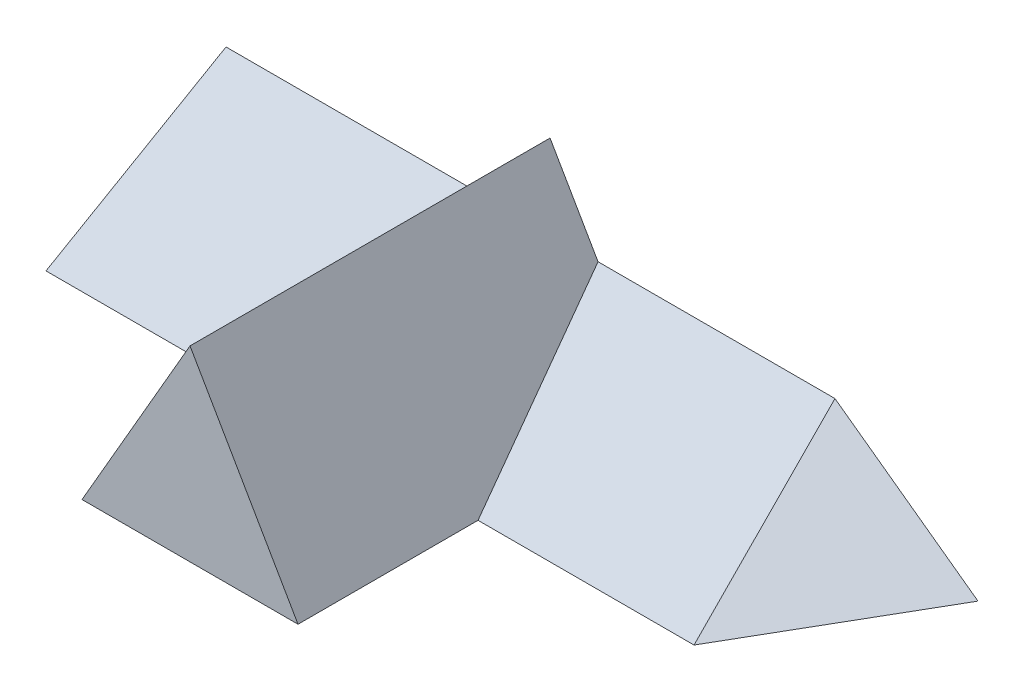
ISO-10303-21;
HEADER;
FILE_DESCRIPTION(('STEP AP214'),'2;1');
FILE_NAME('part.step','',(''),(''),'','','');
FILE_SCHEMA(('AUTOMOTIVE_DESIGN { 1 0 10303 214 1 1 1 1 }'));
ENDSEC;
DATA;
#1=APPLICATION_CONTEXT('core data for automotive mechanical design processes');
#2=APPLICATION_PROTOCOL_DEFINITION('international standard','automotive_design',2000,#1);
#3=PRODUCT_CONTEXT('',#1,'mechanical');
#4=PRODUCT('Part','Part','',(#3));
#5=PRODUCT_RELATED_PRODUCT_CATEGORY('part','',(#4));
#6=PRODUCT_DEFINITION_FORMATION('','',#4);
#7=PRODUCT_DEFINITION_CONTEXT('part definition',#1,'design');
#8=PRODUCT_DEFINITION('design','',#6,#7);
#9=PRODUCT_DEFINITION_SHAPE('','',#8);
#10=(LENGTH_UNIT() NAMED_UNIT(*) SI_UNIT(.MILLI.,.METRE.));
#11=(NAMED_UNIT(*) PLANE_ANGLE_UNIT() SI_UNIT($,.RADIAN.));
#12=(NAMED_UNIT(*) SI_UNIT($,.STERADIAN.) SOLID_ANGLE_UNIT());
#13=UNCERTAINTY_MEASURE_WITH_UNIT(LENGTH_MEASURE(1.E-05),#10,'distance_accuracy_value','');
#14=(GEOMETRIC_REPRESENTATION_CONTEXT(3) GLOBAL_UNCERTAINTY_ASSIGNED_CONTEXT((#13)) GLOBAL_UNIT_ASSIGNED_CONTEXT((#10,
#11,#12)) REPRESENTATION_CONTEXT('',''));
#15=CARTESIAN_POINT('',(0.,0.,0.));
#16=DIRECTION('',(0.,0.,1.));
#17=DIRECTION('',(1.,0.,0.));
#18=AXIS2_PLACEMENT_3D('',#15,#16,#17);
#19=CARTESIAN_POINT('',(30.,0.,-100.));
#20=DIRECTION('',(0.,0.,-1.));
#21=DIRECTION('',(-1.,0.,0.));
#22=AXIS2_PLACEMENT_3D('',#19,#20,#21);
#23=PLANE('',#22);
#24=DIRECTION('',(-1.,0.,0.));
#25=VECTOR('',#24,1.);
#26=CARTESIAN_POINT('',(90.,28.8675134594809,-100.));
#27=LINE('',#26,#25);
#28=CARTESIAN_POINT('',(79.1423937063411,28.8675134594809,-100.));
#29=VERTEX_POINT('',#28);
#30=CARTESIAN_POINT('',(13.3333333333334,28.8675134594809,-100.));
#31=VERTEX_POINT('',#30);
#32=EDGE_CURVE('E63',#29,#31,#27,.T.);
#33=ORIENTED_EDGE('',*,*,#32,.F.);
#34=DIRECTION('',(0.808963493304016,-0.587858883152551,0.));
#35=VECTOR('',#34,1.);
#36=CARTESIAN_POINT('',(60.7106634761115,42.2615126169186,-100.));
#37=LINE('',#36,#35);
#38=CARTESIAN_POINT('',(118.867513459481,0.,-100.));
#39=VERTEX_POINT('',#38);
#40=EDGE_CURVE('E115',#29,#39,#37,.T.);
#41=ORIENTED_EDGE('',*,*,#40,.T.);
#42=DIRECTION('',(-1.,0.,0.));
#43=VECTOR('',#42,1.);
#44=CARTESIAN_POINT('',(118.867513459481,0.,-100.));
#45=LINE('',#44,#43);
#46=CARTESIAN_POINT('',(90.,0.,-100.));
#47=VERTEX_POINT('',#46);
#48=EDGE_CURVE('E116',#39,#47,#45,.T.);
#49=ORIENTED_EDGE('',*,*,#48,.T.);
#50=DIRECTION('',(1.,0.,0.));
#51=VECTOR('',#50,1.);
#52=CARTESIAN_POINT('',(30.,0.,-100.));
#53=LINE('',#52,#51);
#54=CARTESIAN_POINT('',(-90.,0.,-100.));
#55=VERTEX_POINT('',#54);
#56=EDGE_CURVE('E189',#55,#47,#53,.T.);
#57=ORIENTED_EDGE('',*,*,#56,.F.);
#58=DIRECTION('',(0.,1.,0.));
#59=VECTOR('',#58,1.);
#60=CARTESIAN_POINT('',(-90.,28.8675134594809,-100.));
#61=LINE('',#60,#59);
#62=CARTESIAN_POINT('',(-90.,28.8675134594809,-100.));
#63=VERTEX_POINT('',#62);
#64=EDGE_CURVE('E222',#55,#63,#61,.T.);
#65=ORIENTED_EDGE('',*,*,#64,.T.);
#66=CARTESIAN_POINT('',(-13.3333333333333,28.8675134594809,-100.));
#67=VERTEX_POINT('',#66);
#68=EDGE_CURVE('E108',#67,#63,#27,.T.);
#69=ORIENTED_EDGE('',*,*,#68,.F.);
#70=DIRECTION('',(-0.500000000000004,-0.866025403784436,0.));
#71=VECTOR('',#70,1.);
#72=CARTESIAN_POINT('',(-30.,0.,-100.));
#73=LINE('',#72,#71);
#74=CARTESIAN_POINT('',(0.,51.9615242270657,-100.));
#75=VERTEX_POINT('',#74);
#76=EDGE_CURVE('E191',#75,#67,#73,.T.);
#77=ORIENTED_EDGE('',*,*,#76,.F.);
#78=DIRECTION('',(-0.500000000000004,0.866025403784436,0.));
#79=VECTOR('',#78,1.);
#80=CARTESIAN_POINT('',(0.,51.9615242270657,-100.));
#81=LINE('',#80,#79);
#82=EDGE_CURVE('E194',#31,#75,#81,.T.);
#83=ORIENTED_EDGE('',*,*,#82,.F.);
#84=EDGE_LOOP('',(#33,#41,#49,#57,#65,#69,#77,#83));
#85=FACE_BOUND('',#84,.T.);
#86=ADVANCED_FACE('F36',(#85),#23,.T.);
#87=CARTESIAN_POINT('',(90.,0.,-50.));
#88=DIRECTION('',(0.,-0.866025403784441,-0.499999999999995));
#89=DIRECTION('',(0.,0.499999999999995,-0.866025403784442));
#90=AXIS2_PLACEMENT_3D('',#87,#88,#89);
#91=PLANE('',#90);
#92=DIRECTION('',(0.184819464600239,-0.491386244594021,0.851105941777324));
#93=VECTOR('',#92,1.);
#94=CARTESIAN_POINT('',(90.,0.,-50.));
#95=LINE('',#94,#93);
#96=CARTESIAN_POINT('',(90.,0.,-50.));
#97=VERTEX_POINT('',#96);
#98=EDGE_CURVE('E103',#29,#97,#95,.T.);
#99=ORIENTED_EDGE('',*,*,#98,.F.);
#100=ORIENTED_EDGE('',*,*,#32,.T.);
#101=DIRECTION('',(-0.277350098112615,0.480384461415257,-0.832050294337846));
#102=VECTOR('',#101,1.);
#103=CARTESIAN_POINT('',(9.2307692307693,35.97336292643,-112.307692307692));
#104=LINE('',#103,#102);
#105=CARTESIAN_POINT('',(30.,0.,-50.));
#106=VERTEX_POINT('',#105);
#107=EDGE_CURVE('E104',#106,#31,#104,.T.);
#108=ORIENTED_EDGE('',*,*,#107,.F.);
#109=DIRECTION('',(-1.,0.,0.));
#110=VECTOR('',#109,1.);
#111=CARTESIAN_POINT('',(90.,0.,-50.));
#112=LINE('',#111,#110);
#113=EDGE_CURVE('E100',#97,#106,#112,.T.);
#114=ORIENTED_EDGE('',*,*,#113,.F.);
#115=EDGE_LOOP('',(#99,#100,#108,#114));
#116=FACE_BOUND('',#115,.T.);
#117=ADVANCED_FACE('F102',(#116),#91,.F.);
#118=CARTESIAN_POINT('',(0.,51.9615242270657,-100.));
#119=DIRECTION('',(0.866025403784436,0.500000000000004,0.));
#120=DIRECTION('',(-0.500000000000004,0.866025403784436,0.));
#121=AXIS2_PLACEMENT_3D('',#118,#119,#120);
#122=PLANE('',#121);
#123=DIRECTION('',(0.,0.,1.));
#124=VECTOR('',#123,1.);
#125=CARTESIAN_POINT('',(30.,0.,-100.));
#126=LINE('',#125,#124);
#127=CARTESIAN_POINT('',(30.,0.,0.));
#128=VERTEX_POINT('',#127);
#129=EDGE_CURVE('E12',#106,#128,#126,.T.);
#130=ORIENTED_EDGE('',*,*,#129,.F.);
#131=ORIENTED_EDGE('',*,*,#107,.T.);
#132=ORIENTED_EDGE('',*,*,#82,.T.);
#133=DIRECTION('',(0.,0.,1.));
#134=VECTOR('',#133,1.);
#135=CARTESIAN_POINT('',(0.,51.9615242270657,-100.));
#136=LINE('',#135,#134);
#137=CARTESIAN_POINT('',(0.,51.9615242270657,0.));
#138=VERTEX_POINT('',#137);
#139=EDGE_CURVE('E190',#75,#138,#136,.T.);
#140=ORIENTED_EDGE('',*,*,#139,.T.);
#141=DIRECTION('',(-0.500000000000004,0.866025403784436,0.));
#142=VECTOR('',#141,1.);
#143=CARTESIAN_POINT('',(0.,51.9615242270657,0.));
#144=LINE('',#143,#142);
#145=EDGE_CURVE('E202',#128,#138,#144,.T.);
#146=ORIENTED_EDGE('',*,*,#145,.F.);
#147=EDGE_LOOP('',(#130,#131,#132,#140,#146));
#148=FACE_BOUND('',#147,.T.);
#149=ADVANCED_FACE('F38',(#148),#122,.T.);
#150=CARTESIAN_POINT('',(-30.,0.,-100.));
#151=DIRECTION('',(-0.866025403784436,0.500000000000004,0.));
#152=DIRECTION('',(-0.500000000000004,-0.866025403784436,0.));
#153=AXIS2_PLACEMENT_3D('',#150,#151,#152);
#154=PLANE('',#153);
#155=ORIENTED_EDGE('',*,*,#76,.T.);
#156=DIRECTION('',(-0.277350098112615,-0.480384461415257,0.832050294337846));
#157=VECTOR('',#156,1.);
#158=CARTESIAN_POINT('',(-18.4615384615384,19.9852016257946,-84.6153846153848));
#159=LINE('',#158,#157);
#160=CARTESIAN_POINT('',(-30.,0.,-50.));
#161=VERTEX_POINT('',#160);
#162=EDGE_CURVE('E216',#67,#161,#159,.T.);
#163=ORIENTED_EDGE('',*,*,#162,.T.);
#164=DIRECTION('',(0.,0.,1.));
#165=VECTOR('',#164,1.);
#166=CARTESIAN_POINT('',(-30.,0.,-100.));
#167=LINE('',#166,#165);
#168=CARTESIAN_POINT('',(-30.,0.,0.));
#169=VERTEX_POINT('',#168);
#170=EDGE_CURVE('E47',#161,#169,#167,.T.);
#171=ORIENTED_EDGE('',*,*,#170,.T.);
#172=DIRECTION('',(-0.500000000000004,-0.866025403784436,0.));
#173=VECTOR('',#172,1.);
#174=CARTESIAN_POINT('',(-30.,0.,0.));
#175=LINE('',#174,#173);
#176=EDGE_CURVE('E205',#138,#169,#175,.T.);
#177=ORIENTED_EDGE('',*,*,#176,.F.);
#178=ORIENTED_EDGE('',*,*,#139,.F.);
#179=EDGE_LOOP('',(#155,#163,#171,#177,#178));
#180=FACE_BOUND('',#179,.T.);
#181=ADVANCED_FACE('F140',(#180),#154,.T.);
#182=CARTESIAN_POINT('',(30.,0.,-100.));
#183=DIRECTION('',(0.,-1.,0.));
#184=DIRECTION('',(1.,0.,0.));
#185=AXIS2_PLACEMENT_3D('',#182,#183,#184);
#186=PLANE('',#185);
#187=ORIENTED_EDGE('',*,*,#56,.T.);
#188=ORIENTED_EDGE('',*,*,#48,.F.);
#189=DIRECTION('',(0.499999999999995,0.,-0.866025403784442));
#190=VECTOR('',#189,1.);
#191=CARTESIAN_POINT('',(90.,0.,-50.));
#192=LINE('',#191,#190);
#193=EDGE_CURVE('E113',#97,#39,#192,.T.);
#194=ORIENTED_EDGE('',*,*,#193,.F.);
#195=ORIENTED_EDGE('',*,*,#113,.T.);
#196=ORIENTED_EDGE('',*,*,#129,.T.);
#197=DIRECTION('',(1.,0.,0.));
#198=VECTOR('',#197,1.);
#199=CARTESIAN_POINT('',(30.,0.,0.));
#200=LINE('',#199,#198);
#201=EDGE_CURVE('E198',#169,#128,#200,.T.);
#202=ORIENTED_EDGE('',*,*,#201,.F.);
#203=ORIENTED_EDGE('',*,*,#170,.F.);
#204=CARTESIAN_POINT('',(-90.,0.,-50.));
#205=VERTEX_POINT('',#204);
#206=EDGE_CURVE('E55',#161,#205,#112,.T.);
#207=ORIENTED_EDGE('',*,*,#206,.T.);
#208=DIRECTION('',(0.,0.,-1.));
#209=VECTOR('',#208,1.);
#210=CARTESIAN_POINT('',(-90.,0.,-100.));
#211=LINE('',#210,#209);
#212=EDGE_CURVE('E182',#205,#55,#211,.T.);
#213=ORIENTED_EDGE('',*,*,#212,.T.);
#214=EDGE_LOOP('',(#187,#188,#194,#195,#196,#202,#203,#207,#213));
#215=FACE_BOUND('',#214,.T.);
#216=ADVANCED_FACE('F120',(#215),#186,.T.);
#217=CARTESIAN_POINT('',(30.,0.,0.));
#218=DIRECTION('',(0.,0.,-1.));
#219=DIRECTION('',(-1.,0.,0.));
#220=AXIS2_PLACEMENT_3D('',#217,#218,#219);
#221=PLANE('',#220);
#222=ORIENTED_EDGE('',*,*,#145,.T.);
#223=ORIENTED_EDGE('',*,*,#176,.T.);
#224=ORIENTED_EDGE('',*,*,#201,.T.);
#225=EDGE_LOOP('',(#222,#223,#224));
#226=FACE_BOUND('',#225,.T.);
#227=ADVANCED_FACE('F139',(#226),#221,.F.);
#228=CARTESIAN_POINT('',(-90.,0.,-100.));
#229=DIRECTION('',(1.,0.,0.));
#230=DIRECTION('',(0.,0.,-1.));
#231=AXIS2_PLACEMENT_3D('',#228,#229,#230);
#232=PLANE('',#231);
#233=ORIENTED_EDGE('',*,*,#212,.F.);
#234=DIRECTION('',(0.,-0.499999999999995,0.866025403784441));
#235=VECTOR('',#234,1.);
#236=CARTESIAN_POINT('',(-90.,0.,-50.));
#237=LINE('',#236,#235);
#238=EDGE_CURVE('E214',#63,#205,#237,.T.);
#239=ORIENTED_EDGE('',*,*,#238,.F.);
#240=ORIENTED_EDGE('',*,*,#64,.F.);
#241=EDGE_LOOP('',(#233,#239,#240));
#242=FACE_BOUND('',#241,.T.);
#243=ADVANCED_FACE('F159',(#242),#232,.F.);
#244=ORIENTED_EDGE('',*,*,#162,.F.);
#245=ORIENTED_EDGE('',*,*,#68,.T.);
#246=ORIENTED_EDGE('',*,*,#238,.T.);
#247=ORIENTED_EDGE('',*,*,#206,.F.);
#248=EDGE_LOOP('',(#244,#245,#246,#247));
#249=FACE_BOUND('',#248,.T.);
#250=ADVANCED_FACE('F155',(#249),#91,.F.);
#251=CARTESIAN_POINT('',(180.,0.,-205.884572681199));
#252=DIRECTION('',(0.556670399226415,0.766044443118982,0.321393804843268));
#253=DIRECTION('',(-0.808963493304016,0.587858883152551,0.));
#254=AXIS2_PLACEMENT_3D('',#251,#252,#253);
#255=PLANE('',#254);
#256=ORIENTED_EDGE('',*,*,#98,.T.);
#257=ORIENTED_EDGE('',*,*,#193,.T.);
#258=ORIENTED_EDGE('',*,*,#40,.F.);
#259=EDGE_LOOP('',(#256,#257,#258));
#260=FACE_BOUND('',#259,.T.);
#261=ADVANCED_FACE('F112',(#260),#255,.T.);
#262=CLOSED_SHELL('',(#86,#117,#149,#181,#216,#227,#243,#250,#261));
#263=MANIFOLD_SOLID_BREP('B2',#262);
#264=ADVANCED_BREP_SHAPE_REPRESENTATION('',(#18,#263),#14);
#265=SHAPE_DEFINITION_REPRESENTATION(#9,#264);
ENDSEC;
END-ISO-10303-21;
